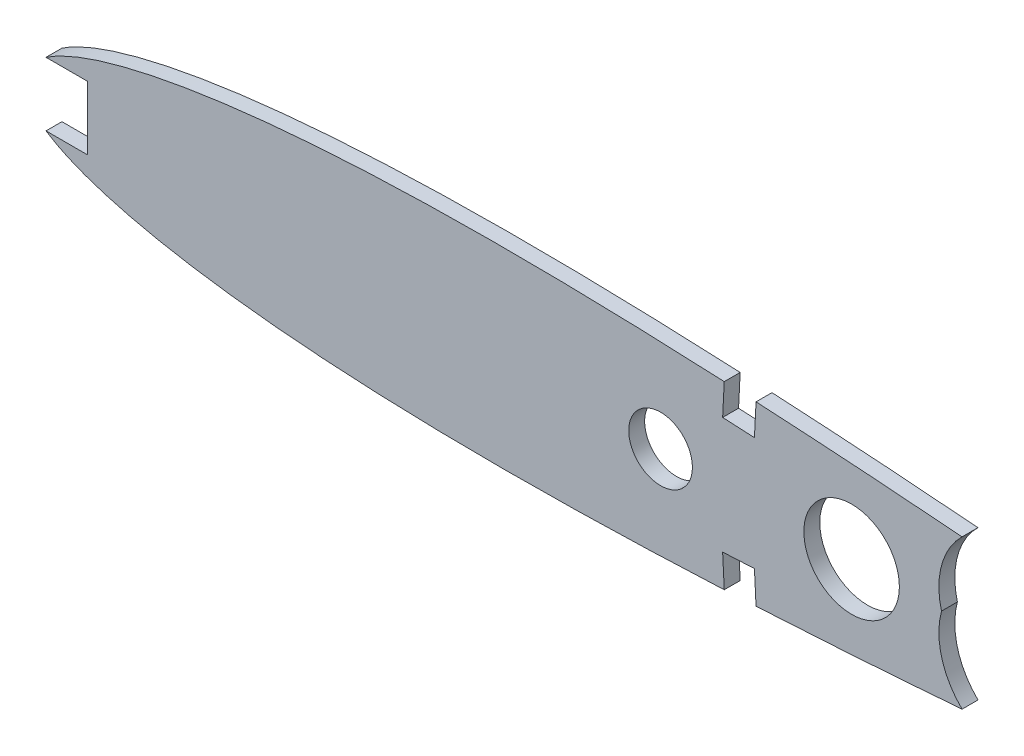
ISO-10303-21;
HEADER;
FILE_DESCRIPTION(('STEP AP214'),'2;1');
FILE_NAME('part.step','',(''),(''),'','','');
FILE_SCHEMA(('AUTOMOTIVE_DESIGN { 1 0 10303 214 1 1 1 1 }'));
ENDSEC;
DATA;
#1=APPLICATION_CONTEXT('core data for automotive mechanical design processes');
#2=APPLICATION_PROTOCOL_DEFINITION('international standard','automotive_design',2000,#1);
#3=PRODUCT_CONTEXT('',#1,'mechanical');
#4=PRODUCT('Part','Part','',(#3));
#5=PRODUCT_RELATED_PRODUCT_CATEGORY('part','',(#4));
#6=PRODUCT_DEFINITION_FORMATION('','',#4);
#7=PRODUCT_DEFINITION_CONTEXT('part definition',#1,'design');
#8=PRODUCT_DEFINITION('design','',#6,#7);
#9=PRODUCT_DEFINITION_SHAPE('','',#8);
#10=(LENGTH_UNIT() NAMED_UNIT(*) SI_UNIT(.MILLI.,.METRE.));
#11=(NAMED_UNIT(*) PLANE_ANGLE_UNIT() SI_UNIT($,.RADIAN.));
#12=(NAMED_UNIT(*) SI_UNIT($,.STERADIAN.) SOLID_ANGLE_UNIT());
#13=UNCERTAINTY_MEASURE_WITH_UNIT(LENGTH_MEASURE(1.E-05),#10,'distance_accuracy_value','');
#14=(GEOMETRIC_REPRESENTATION_CONTEXT(3) GLOBAL_UNCERTAINTY_ASSIGNED_CONTEXT((#13)) GLOBAL_UNIT_ASSIGNED_CONTEXT((#10,
#11,#12)) REPRESENTATION_CONTEXT('',''));
#15=CARTESIAN_POINT('',(0.,0.,0.));
#16=DIRECTION('',(0.,0.,1.));
#17=DIRECTION('',(1.,0.,0.));
#18=AXIS2_PLACEMENT_3D('',#15,#16,#17);
#19=CARTESIAN_POINT('',(318.77,0.4016502,3.175));
#20=CARTESIAN_POINT('',(318.651672050798,0.50081062510207,3.175));
#21=CARTESIAN_POINT('',(317.88713952083,0.407183951533016,3.175));
#22=CARTESIAN_POINT('',(316.525702267064,0.7904298347905,3.175));
#23=CARTESIAN_POINT('',(314.029007456015,1.02731081399014,3.175));
#24=CARTESIAN_POINT('',(310.665580367581,1.53568645613262,3.175));
#25=CARTESIAN_POINT('',(306.332982445315,2.1029997142592,3.175));
#26=CARTESIAN_POINT('',(301.108142880642,2.80218722429085,3.175));
#27=CARTESIAN_POINT('',(295.004655139781,3.59255228155884,3.175));
#28=CARTESIAN_POINT('',(288.066717305627,4.47252129999186,3.175));
#29=CARTESIAN_POINT('',(280.334877507848,5.42667867616247,3.175));
#30=CARTESIAN_POINT('',(271.857503413929,6.44211126091389,3.175));
#31=CARTESIAN_POINT('',(262.68670258513,7.50622472654808,3.175));
#32=CARTESIAN_POINT('',(252.878949160097,8.60453143464443,3.175));
#33=CARTESIAN_POINT('',(242.494745531819,9.72362194936592,3.175));
#34=CARTESIAN_POINT('',(231.598187206488,10.8495970231666,3.175));
#35=CARTESIAN_POINT('',(220.256428580463,11.9679230852741,3.175));
#36=CARTESIAN_POINT('',(208.539426289446,13.0629021970691,3.175));
#37=CARTESIAN_POINT('',(196.519338709918,14.1201595424354,3.175));
#38=CARTESIAN_POINT('',(184.270405083069,15.1220196708537,3.175));
#39=CARTESIAN_POINT('',(171.867889748649,16.0521472129467,3.175));
#40=CARTESIAN_POINT('',(159.388371015463,16.8932736087619,3.175));
#41=CARTESIAN_POINT('',(146.908740176365,17.6278116310836,3.175));
#42=CARTESIAN_POINT('',(134.505824676557,18.23720410278,3.175));
#43=CARTESIAN_POINT('',(122.256224526093,18.705201006698,3.175));
#44=CARTESIAN_POINT('',(110.23510919994,19.0165345268771,3.175));
#45=CARTESIAN_POINT('',(98.5167667377854,19.1559979551147,3.175));
#46=CARTESIAN_POINT('',(87.1732015056204,19.1125234147679,3.175));
#47=CARTESIAN_POINT('',(76.2743495407503,18.8777134468916,3.175));
#48=CARTESIAN_POINT('',(65.8872982521429,18.4456158754961,3.175));
#49=CARTESIAN_POINT('',(56.0759819312477,17.8151004006929,3.175));
#50=CARTESIAN_POINT('',(46.9007012854392,16.9880642018893,3.175));
#51=CARTESIAN_POINT('',(38.4176025007467,15.9709664672286,3.175));
#52=CARTESIAN_POINT('',(30.6783927826995,14.7724611931374,3.175));
#53=CARTESIAN_POINT('',(23.7299698701266,13.4050657428601,3.175));
#54=CARTESIAN_POINT('',(17.6130594258367,11.8842416218078,3.175));
#55=CARTESIAN_POINT('',(12.3624203887116,10.2248187616682,3.175));
#56=CARTESIAN_POINT('',(8.00472945000562,8.44225238170004,3.175));
#57=CARTESIAN_POINT('',(4.55388340735938,6.54860238146803,3.175));
#58=CARTESIAN_POINT('',(2.01519229032135,4.54013127991722,3.175));
#59=CARTESIAN_POINT('',(0.389181284538515,2.36824959719999,3.175));
#60=CARTESIAN_POINT('',(-0.181372315669338,0.,3.175));
#61=CARTESIAN_POINT('',(0.389181284538492,-2.36824959719995,3.175));
#62=CARTESIAN_POINT('',(2.01519229032142,-4.5401312799173,3.175));
#63=CARTESIAN_POINT('',(4.55388340735933,-6.54860238146799,3.175));
#64=CARTESIAN_POINT('',(8.00472945000561,-8.44225238170004,3.175));
#65=CARTESIAN_POINT('',(12.3624203887116,-10.2248187616682,3.175));
#66=CARTESIAN_POINT('',(17.6130594258367,-11.8842416218078,3.175));
#67=CARTESIAN_POINT('',(23.7299698701266,-13.4050657428601,3.175));
#68=CARTESIAN_POINT('',(30.6783927826996,-14.7724611931374,3.175));
#69=CARTESIAN_POINT('',(38.4176025007467,-15.9709664672285,3.175));
#70=CARTESIAN_POINT('',(46.9007012854392,-16.9880642018893,3.175));
#71=CARTESIAN_POINT('',(56.0759819312477,-17.8151004006929,3.175));
#72=CARTESIAN_POINT('',(65.8872982521429,-18.4456158754961,3.175));
#73=CARTESIAN_POINT('',(76.2743495407503,-18.8777134468916,3.175));
#74=CARTESIAN_POINT('',(87.1732015056205,-19.1125234147679,3.175));
#75=CARTESIAN_POINT('',(98.5167667377854,-19.1559979551147,3.175));
#76=CARTESIAN_POINT('',(110.23510919994,-19.0165345268771,3.175));
#77=CARTESIAN_POINT('',(122.256224526093,-18.705201006698,3.175));
#78=CARTESIAN_POINT('',(134.505824676556,-18.23720410278,3.175));
#79=CARTESIAN_POINT('',(146.908740176365,-17.6278116310836,3.175));
#80=CARTESIAN_POINT('',(159.388371015463,-16.8932736087619,3.175));
#81=CARTESIAN_POINT('',(171.867889748649,-16.0521472129467,3.175));
#82=CARTESIAN_POINT('',(184.270405083069,-15.1220196708537,3.175));
#83=CARTESIAN_POINT('',(196.519338709918,-14.1201595424354,3.175));
#84=CARTESIAN_POINT('',(208.539426289446,-13.0629021970691,3.175));
#85=CARTESIAN_POINT('',(220.256428580463,-11.9679230852741,3.175));
#86=CARTESIAN_POINT('',(231.598187206488,-10.8495970231665,3.175));
#87=CARTESIAN_POINT('',(242.494745531819,-9.72362194936593,3.175));
#88=CARTESIAN_POINT('',(252.878949160097,-8.60453143464443,3.175));
#89=CARTESIAN_POINT('',(262.68670258513,-7.50622472654809,3.175));
#90=CARTESIAN_POINT('',(271.857503413929,-6.44211126091389,3.175));
#91=CARTESIAN_POINT('',(280.334877507848,-5.42667867616247,3.175));
#92=CARTESIAN_POINT('',(288.066717305627,-4.47252129999186,3.175));
#93=CARTESIAN_POINT('',(295.004655139781,-3.59255228155884,3.175));
#94=CARTESIAN_POINT('',(301.108142880642,-2.80218722429085,3.175));
#95=CARTESIAN_POINT('',(306.332982445315,-2.10299971425921,3.175));
#96=CARTESIAN_POINT('',(310.66558036758,-1.53568645613261,3.175));
#97=CARTESIAN_POINT('',(314.029007456015,-1.02731081399015,3.175));
#98=CARTESIAN_POINT('',(316.525702267064,-0.790429834790499,3.175));
#99=CARTESIAN_POINT('',(317.88713952083,-0.407183951532999,3.175));
#100=CARTESIAN_POINT('',(318.961628570184,-0.538768719393173,3.175));
#101=CARTESIAN_POINT('',(318.961628570184,0.241062861088163,3.175));
#102=CARTESIAN_POINT('',(318.77,0.4016502,3.175));
#103=B_SPLINE_CURVE_WITH_KNOTS('',3,(#19,#20,#21,#22,#23,#24,#25,#26,#27,#28,#29,#30,#31,#32,
#33,#34,#35,#36,#37,#38,#39,#40,#41,#42,#43,#44,#45,#46,#47,#48,#49,#50,#51,#52,#53,#54,#55,#56,
#57,#58,#59,#60,#61,#62,#63,#64,#65,#66,#67,#68,#69,#70,#71,#72,#73,#74,#75,#76,#77,#78,#79,#80,
#81,#82,#83,#84,#85,#86,#87,#88,#89,#90,#91,#92,#93,#94,#95,#96,#97,#98,#99,#100,#101,#102),
.UNSPECIFIED.,.T.,.F.,(4,1,1,1,1,1,1,1,1,1,1,1,1,1,1,1,1,1,1,1,1,1,1,1,1,1,1,1,1,1,1,1,1,1,1,1,
1,1,1,1,1,1,1,1,1,1,1,1,1,1,1,1,1,1,1,1,1,1,1,1,1,1,1,1,1,1,1,1,1,1,1,1,1,1,1,1,1,1,1,1,1,4),
(0.,0.00076221465102857,0.00304470631082172,0.00683224554312919,0.0121011758037585,
0.0188175356586858,0.026939454793122,0.0364148482585568,0.0471846285955964,0.0591804130998147,
0.0723278736139124,0.0865440610891483,0.101740580336553,0.117823336433574,0.134691452208322,
0.152240154447155,0.170361289964637,0.188941007849542,0.207865435445639,0.227016078022501,
0.246275695980001,0.265524943249896,0.284644966110444,0.303520118268662,0.322034575374331,
0.340078352914118,0.357542593241702,0.374325481920834,0.390329890871888,0.405463889739095,
0.419643801445685,0.43279337139134,0.444843816743186,0.455737920704734,0.465428653233085,
0.473886320085416,0.481101634077569,0.487101684418678,0.491975368345093,0.495930677807379,
0.499382808099288,0.502834938391198,0.506790247853484,0.511663931779899,0.517663982121008,
0.524879296113161,0.533336962965492,0.543027695493843,0.553921799455391,0.565972244807237,
0.579121814752892,0.593301726459482,0.608435725326689,0.624440134277742,0.641223022956875,
0.658687263284459,0.676731040824246,0.695245497929915,0.714120650088133,0.733240672948681,
0.752489920218576,0.771749538176075,0.790900180752937,0.809824608349034,0.82840432623394,
0.846525461751422,0.864074163990254,0.880942279765002,0.897025035862024,0.912221555109428,
0.926437742584664,0.939585203098762,0.95158098760298,0.96235076794002,0.971826161405454,
0.97994808053989,0.986664440394818,0.991933370655447,0.995720909887755,0.998003401547548,
0.998765616198576,1.),.UNSPECIFIED.);
#104=DIRECTION('',(0.,0.,-1.));
#105=VECTOR('',#104,1.);
#106=SURFACE_OF_LINEAR_EXTRUSION('',#103,#105);
#107=CARTESIAN_POINT('',(318.77,0.4016502,0.));
#108=CARTESIAN_POINT('',(318.651672050798,0.50081062510207,0.));
#109=CARTESIAN_POINT('',(317.88713952083,0.407183951533016,0.));
#110=CARTESIAN_POINT('',(316.525702267064,0.7904298347905,0.));
#111=CARTESIAN_POINT('',(314.029007456015,1.02731081399014,0.));
#112=CARTESIAN_POINT('',(310.665580367581,1.53568645613262,0.));
#113=CARTESIAN_POINT('',(306.332982445315,2.1029997142592,0.));
#114=CARTESIAN_POINT('',(301.108142880642,2.80218722429085,0.));
#115=CARTESIAN_POINT('',(295.004655139781,3.59255228155884,0.));
#116=CARTESIAN_POINT('',(288.066717305627,4.47252129999186,0.));
#117=CARTESIAN_POINT('',(280.334877507848,5.42667867616247,0.));
#118=CARTESIAN_POINT('',(271.857503413929,6.44211126091389,0.));
#119=CARTESIAN_POINT('',(262.68670258513,7.50622472654808,0.));
#120=CARTESIAN_POINT('',(252.878949160097,8.60453143464443,0.));
#121=CARTESIAN_POINT('',(242.494745531819,9.72362194936592,0.));
#122=CARTESIAN_POINT('',(231.598187206488,10.8495970231666,0.));
#123=CARTESIAN_POINT('',(220.256428580463,11.9679230852741,0.));
#124=CARTESIAN_POINT('',(208.539426289446,13.0629021970691,0.));
#125=CARTESIAN_POINT('',(196.519338709918,14.1201595424354,0.));
#126=CARTESIAN_POINT('',(184.270405083069,15.1220196708537,0.));
#127=CARTESIAN_POINT('',(171.867889748649,16.0521472129467,0.));
#128=CARTESIAN_POINT('',(159.388371015463,16.8932736087619,0.));
#129=CARTESIAN_POINT('',(146.908740176365,17.6278116310836,0.));
#130=CARTESIAN_POINT('',(134.505824676557,18.23720410278,0.));
#131=CARTESIAN_POINT('',(122.256224526093,18.705201006698,0.));
#132=CARTESIAN_POINT('',(110.23510919994,19.0165345268771,0.));
#133=CARTESIAN_POINT('',(98.5167667377854,19.1559979551147,0.));
#134=CARTESIAN_POINT('',(87.1732015056204,19.1125234147679,0.));
#135=CARTESIAN_POINT('',(76.2743495407503,18.8777134468916,0.));
#136=CARTESIAN_POINT('',(65.8872982521429,18.4456158754961,0.));
#137=CARTESIAN_POINT('',(56.0759819312477,17.8151004006929,0.));
#138=CARTESIAN_POINT('',(46.9007012854392,16.9880642018893,0.));
#139=CARTESIAN_POINT('',(38.4176025007467,15.9709664672286,0.));
#140=CARTESIAN_POINT('',(30.6783927826995,14.7724611931374,0.));
#141=CARTESIAN_POINT('',(23.7299698701266,13.4050657428601,0.));
#142=CARTESIAN_POINT('',(17.6130594258367,11.8842416218078,0.));
#143=CARTESIAN_POINT('',(12.3624203887116,10.2248187616682,0.));
#144=CARTESIAN_POINT('',(8.00472945000562,8.44225238170004,0.));
#145=CARTESIAN_POINT('',(4.55388340735938,6.54860238146803,0.));
#146=CARTESIAN_POINT('',(2.01519229032135,4.54013127991722,0.));
#147=CARTESIAN_POINT('',(0.389181284538515,2.36824959719999,0.));
#148=CARTESIAN_POINT('',(-0.181372315669338,0.,0.));
#149=CARTESIAN_POINT('',(0.389181284538492,-2.36824959719995,0.));
#150=CARTESIAN_POINT('',(2.01519229032142,-4.5401312799173,0.));
#151=CARTESIAN_POINT('',(4.55388340735933,-6.54860238146799,0.));
#152=CARTESIAN_POINT('',(8.00472945000561,-8.44225238170004,0.));
#153=CARTESIAN_POINT('',(12.3624203887116,-10.2248187616682,0.));
#154=CARTESIAN_POINT('',(17.6130594258367,-11.8842416218078,0.));
#155=CARTESIAN_POINT('',(23.7299698701266,-13.4050657428601,0.));
#156=CARTESIAN_POINT('',(30.6783927826996,-14.7724611931374,0.));
#157=CARTESIAN_POINT('',(38.4176025007467,-15.9709664672285,0.));
#158=CARTESIAN_POINT('',(46.9007012854392,-16.9880642018893,0.));
#159=CARTESIAN_POINT('',(56.0759819312477,-17.8151004006929,0.));
#160=CARTESIAN_POINT('',(65.8872982521429,-18.4456158754961,0.));
#161=CARTESIAN_POINT('',(76.2743495407503,-18.8777134468916,0.));
#162=CARTESIAN_POINT('',(87.1732015056205,-19.1125234147679,0.));
#163=CARTESIAN_POINT('',(98.5167667377854,-19.1559979551147,0.));
#164=CARTESIAN_POINT('',(110.23510919994,-19.0165345268771,0.));
#165=CARTESIAN_POINT('',(122.256224526093,-18.705201006698,0.));
#166=CARTESIAN_POINT('',(134.505824676556,-18.23720410278,0.));
#167=CARTESIAN_POINT('',(146.908740176365,-17.6278116310836,0.));
#168=CARTESIAN_POINT('',(159.388371015463,-16.8932736087619,0.));
#169=CARTESIAN_POINT('',(171.867889748649,-16.0521472129467,0.));
#170=CARTESIAN_POINT('',(184.270405083069,-15.1220196708537,0.));
#171=CARTESIAN_POINT('',(196.519338709918,-14.1201595424354,0.));
#172=CARTESIAN_POINT('',(208.539426289446,-13.0629021970691,0.));
#173=CARTESIAN_POINT('',(220.256428580463,-11.9679230852741,0.));
#174=CARTESIAN_POINT('',(231.598187206488,-10.8495970231665,0.));
#175=CARTESIAN_POINT('',(242.494745531819,-9.72362194936593,0.));
#176=CARTESIAN_POINT('',(252.878949160097,-8.60453143464443,0.));
#177=CARTESIAN_POINT('',(262.68670258513,-7.50622472654809,0.));
#178=CARTESIAN_POINT('',(271.857503413929,-6.44211126091389,0.));
#179=CARTESIAN_POINT('',(280.334877507848,-5.42667867616247,0.));
#180=CARTESIAN_POINT('',(288.066717305627,-4.47252129999186,0.));
#181=CARTESIAN_POINT('',(295.004655139781,-3.59255228155884,0.));
#182=CARTESIAN_POINT('',(301.108142880642,-2.80218722429085,0.));
#183=CARTESIAN_POINT('',(306.332982445315,-2.10299971425921,0.));
#184=CARTESIAN_POINT('',(310.66558036758,-1.53568645613261,0.));
#185=CARTESIAN_POINT('',(314.029007456015,-1.02731081399015,0.));
#186=CARTESIAN_POINT('',(316.525702267064,-0.790429834790499,0.));
#187=CARTESIAN_POINT('',(317.88713952083,-0.407183951532999,0.));
#188=CARTESIAN_POINT('',(318.961628570184,-0.538768719393173,0.));
#189=CARTESIAN_POINT('',(318.961628570184,0.241062861088163,0.));
#190=CARTESIAN_POINT('',(318.77,0.4016502,0.));
#191=B_SPLINE_CURVE_WITH_KNOTS('',3,(#107,#108,#109,#110,#111,#112,#113,#114,#115,#116,#117,
#118,#119,#120,#121,#122,#123,#124,#125,#126,#127,#128,#129,#130,#131,#132,#133,#134,#135,#136,
#137,#138,#139,#140,#141,#142,#143,#144,#145,#146,#147,#148,#149,#150,#151,#152,#153,#154,#155,
#156,#157,#158,#159,#160,#161,#162,#163,#164,#165,#166,#167,#168,#169,#170,#171,#172,#173,#174,
#175,#176,#177,#178,#179,#180,#181,#182,#183,#184,#185,#186,#187,#188,#189,#190),.UNSPECIFIED.,
.T.,.F.,(4,1,1,1,1,1,1,1,1,1,1,1,1,1,1,1,1,1,1,1,1,1,1,1,1,1,1,1,1,1,1,1,1,1,1,1,1,1,1,1,1,1,1,
1,1,1,1,1,1,1,1,1,1,1,1,1,1,1,1,1,1,1,1,1,1,1,1,1,1,1,1,1,1,1,1,1,1,1,1,1,1,4),(0.,
0.00076221465102857,0.00304470631082172,0.00683224554312919,0.0121011758037585,
0.0188175356586858,0.026939454793122,0.0364148482585568,0.0471846285955964,0.0591804130998147,
0.0723278736139124,0.0865440610891483,0.101740580336553,0.117823336433574,0.134691452208322,
0.152240154447155,0.170361289964637,0.188941007849542,0.207865435445639,0.227016078022501,
0.246275695980001,0.265524943249896,0.284644966110444,0.303520118268662,0.322034575374331,
0.340078352914118,0.357542593241702,0.374325481920834,0.390329890871888,0.405463889739095,
0.419643801445685,0.43279337139134,0.444843816743186,0.455737920704734,0.465428653233085,
0.473886320085416,0.481101634077569,0.487101684418678,0.491975368345093,0.495930677807379,
0.499382808099288,0.502834938391198,0.506790247853484,0.511663931779899,0.517663982121008,
0.524879296113161,0.533336962965492,0.543027695493843,0.553921799455391,0.565972244807237,
0.579121814752892,0.593301726459482,0.608435725326689,0.624440134277742,0.641223022956875,
0.658687263284459,0.676731040824246,0.695245497929915,0.714120650088133,0.733240672948681,
0.752489920218576,0.771749538176075,0.790900180752937,0.809824608349034,0.82840432623394,
0.846525461751422,0.864074163990254,0.880942279765002,0.897025035862024,0.912221555109428,
0.926437742584664,0.939585203098762,0.95158098760298,0.96235076794002,0.971826161405454,
0.97994808053989,0.986664440394818,0.991933370655447,0.995720909887755,0.998003401547548,
0.998765616198576,1.),.UNSPECIFIED.);
#192=CARTESIAN_POINT('',(146.04183221628,-17.6541230833231,0.));
#193=VERTEX_POINT('',#192);
#194=CARTESIAN_POINT('',(187.131379050379,-14.8815283728172,0.));
#195=VERTEX_POINT('',#194);
#196=EDGE_CURVE('E317',#193,#195,#191,.T.);
#197=ORIENTED_EDGE('',*,*,#196,.T.);
#198=DIRECTION('',(0.,0.,-1.));
#199=VECTOR('',#198,1.);
#200=CARTESIAN_POINT('',(187.131379050379,-14.8815283728172,3.175));
#201=LINE('',#200,#199);
#202=CARTESIAN_POINT('',(187.131379050379,-14.8815283728172,3.175));
#203=VERTEX_POINT('',#202);
#204=EDGE_CURVE('E197',#195,#203,#201,.F.);
#205=ORIENTED_EDGE('',*,*,#204,.T.);
#206=CARTESIAN_POINT('',(146.04183221628,-17.6541230833231,3.175));
#207=VERTEX_POINT('',#206);
#208=EDGE_CURVE('E185',#207,#203,#103,.T.);
#209=ORIENTED_EDGE('',*,*,#208,.F.);
#210=DIRECTION('',(0.,0.,-1.));
#211=VECTOR('',#210,1.);
#212=CARTESIAN_POINT('',(146.041832216277,-17.6541230832735,3.175));
#213=LINE('',#212,#211);
#214=EDGE_CURVE('E258',#207,#193,#213,.T.);
#215=ORIENTED_EDGE('',*,*,#214,.T.);
#216=EDGE_LOOP('',(#197,#205,#209,#215));
#217=FACE_BOUND('',#216,.T.);
#218=ADVANCED_FACE('F56',(#217),#106,.F.);
#219=DIRECTION('',(0.,0.,-1.));
#220=VECTOR('',#219,1.);
#221=CARTESIAN_POINT('',(4.43514152489335,-6.35,3.175));
#222=LINE('',#221,#220);
#223=CARTESIAN_POINT('',(4.43514152741509,-6.35,0.));
#224=VERTEX_POINT('',#223);
#225=CARTESIAN_POINT('',(4.43514152741509,-6.35,3.175));
#226=VERTEX_POINT('',#225);
#227=EDGE_CURVE('E224',#224,#226,#222,.F.);
#228=ORIENTED_EDGE('',*,*,#227,.F.);
#229=CARTESIAN_POINT('',(139.700000000002,-17.9760922442452,0.));
#230=VERTEX_POINT('',#229);
#231=EDGE_CURVE('E326',#224,#230,#191,.T.);
#232=ORIENTED_EDGE('',*,*,#231,.T.);
#233=DIRECTION('',(0.,0.,-1.));
#234=VECTOR('',#233,1.);
#235=CARTESIAN_POINT('',(139.7,-17.9760922441977,3.175));
#236=LINE('',#235,#234);
#237=CARTESIAN_POINT('',(139.700000000002,-17.9760922442452,3.175));
#238=VERTEX_POINT('',#237);
#239=EDGE_CURVE('E297',#230,#238,#236,.F.);
#240=ORIENTED_EDGE('',*,*,#239,.T.);
#241=EDGE_CURVE('E314',#226,#238,#103,.T.);
#242=ORIENTED_EDGE('',*,*,#241,.F.);
#243=EDGE_LOOP('',(#228,#232,#240,#242));
#244=FACE_BOUND('',#243,.T.);
#245=ADVANCED_FACE('F58',(#244),#106,.F.);
#246=CARTESIAN_POINT('',(139.700000000002,17.9760922442452,0.));
#247=VERTEX_POINT('',#246);
#248=CARTESIAN_POINT('',(4.435141527415,6.35,0.));
#249=VERTEX_POINT('',#248);
#250=EDGE_CURVE('E327',#247,#249,#191,.T.);
#251=ORIENTED_EDGE('',*,*,#250,.T.);
#252=DIRECTION('',(0.,0.,-1.));
#253=VECTOR('',#252,1.);
#254=CARTESIAN_POINT('',(4.43514152489341,6.35000000000004,3.175));
#255=LINE('',#254,#253);
#256=CARTESIAN_POINT('',(4.435141527415,6.35,3.175));
#257=VERTEX_POINT('',#256);
#258=EDGE_CURVE('E229',#249,#257,#255,.F.);
#259=ORIENTED_EDGE('',*,*,#258,.T.);
#260=CARTESIAN_POINT('',(139.700000000002,17.9760922442452,3.175));
#261=VERTEX_POINT('',#260);
#262=EDGE_CURVE('E316',#261,#257,#103,.T.);
#263=ORIENTED_EDGE('',*,*,#262,.F.);
#264=DIRECTION('',(0.,0.,-1.));
#265=VECTOR('',#264,1.);
#266=CARTESIAN_POINT('',(139.7,17.9760922441977,3.175));
#267=LINE('',#266,#265);
#268=EDGE_CURVE('E301',#261,#247,#267,.T.);
#269=ORIENTED_EDGE('',*,*,#268,.T.);
#270=EDGE_LOOP('',(#251,#259,#263,#269));
#271=FACE_BOUND('',#270,.T.);
#272=ADVANCED_FACE('F346',(#271),#106,.F.);
#273=CARTESIAN_POINT('',(187.131379050379,14.8815283728172,3.175));
#274=VERTEX_POINT('',#273);
#275=CARTESIAN_POINT('',(146.04183221628,17.6541230833231,3.175));
#276=VERTEX_POINT('',#275);
#277=EDGE_CURVE('E315',#274,#276,#103,.T.);
#278=ORIENTED_EDGE('',*,*,#277,.F.);
#279=DIRECTION('',(0.,0.,-1.));
#280=VECTOR('',#279,1.);
#281=CARTESIAN_POINT('',(187.131379050379,14.8815283728172,3.175));
#282=LINE('',#281,#280);
#283=CARTESIAN_POINT('',(187.131379050379,14.8815283728172,0.));
#284=VERTEX_POINT('',#283);
#285=EDGE_CURVE('E170',#274,#284,#282,.T.);
#286=ORIENTED_EDGE('',*,*,#285,.T.);
#287=CARTESIAN_POINT('',(146.04183221628,17.6541230833231,0.));
#288=VERTEX_POINT('',#287);
#289=EDGE_CURVE('E308',#284,#288,#191,.T.);
#290=ORIENTED_EDGE('',*,*,#289,.T.);
#291=DIRECTION('',(0.,0.,-1.));
#292=VECTOR('',#291,1.);
#293=CARTESIAN_POINT('',(146.041832216277,17.6541230832735,3.175));
#294=LINE('',#293,#292);
#295=EDGE_CURVE('E305',#288,#276,#294,.F.);
#296=ORIENTED_EDGE('',*,*,#295,.T.);
#297=EDGE_LOOP('',(#278,#286,#290,#296));
#298=FACE_BOUND('',#297,.T.);
#299=ADVANCED_FACE('F366',(#298),#106,.F.);
#300=CARTESIAN_POINT('',(0.0170900845920282,-0.403411610866982,3.175));
#301=DIRECTION('',(0.,0.,-1.));
#302=DIRECTION('',(-1.,0.,0.));
#303=AXIS2_PLACEMENT_3D('',#300,#301,#302);
#304=PLANE('',#303);
#305=CARTESIAN_POINT('',(165.1,0.,3.175));
#306=DIRECTION('',(0.,0.,1.));
#307=DIRECTION('',(1.,0.,0.));
#308=AXIS2_PLACEMENT_3D('',#305,#306,#307);
#309=CIRCLE('',#308,9.525);
#310=CARTESIAN_POINT('',(174.625,0.,3.175));
#311=VERTEX_POINT('',#310);
#312=EDGE_CURVE('E191',#311,#311,#309,.T.);
#313=ORIENTED_EDGE('',*,*,#312,.F.);
#314=EDGE_LOOP('',(#313));
#315=FACE_BOUND('',#314,.T.);
#316=CARTESIAN_POINT('',(127.,0.,3.175));
#317=DIRECTION('',(0.,0.,1.));
#318=DIRECTION('',(1.,0.,0.));
#319=AXIS2_PLACEMENT_3D('',#316,#317,#318);
#320=CIRCLE('',#319,6.35);
#321=CARTESIAN_POINT('',(133.35,0.,3.175));
#322=VERTEX_POINT('',#321);
#323=EDGE_CURVE('E265',#322,#322,#320,.T.);
#324=ORIENTED_EDGE('',*,*,#323,.F.);
#325=EDGE_LOOP('',(#324));
#326=FACE_BOUND('',#325,.T.);
#327=ORIENTED_EDGE('',*,*,#208,.T.);
#328=CARTESIAN_POINT('',(197.744431020284,-3.94440224736243,3.175));
#329=DIRECTION('',(0.,0.,1.));
#330=DIRECTION('',(1.,0.,0.));
#331=AXIS2_PLACEMENT_3D('',#328,#329,#330);
#332=CIRCLE('',#331,15.24);
#333=CARTESIAN_POINT('',(183.023721427638,0.,3.175));
#334=VERTEX_POINT('',#333);
#335=EDGE_CURVE('E175',#334,#203,#332,.T.);
#336=ORIENTED_EDGE('',*,*,#335,.F.);
#337=CARTESIAN_POINT('',(197.744431020284,3.94440224736244,3.175));
#338=DIRECTION('',(0.,0.,1.));
#339=DIRECTION('',(1.,0.,0.));
#340=AXIS2_PLACEMENT_3D('',#337,#338,#339);
#341=CIRCLE('',#340,15.24);
#342=EDGE_CURVE('E165',#274,#334,#341,.T.);
#343=ORIENTED_EDGE('',*,*,#342,.F.);
#344=ORIENTED_EDGE('',*,*,#277,.T.);
#345=DIRECTION('',(0.050703804869963,0.998713734846832,0.));
#346=VECTOR('',#345,1.);
#347=CARTESIAN_POINT('',(146.041832216277,17.6541230832735,3.175));
#348=LINE('',#347,#346);
#349=CARTESIAN_POINT('',(145.719448384264,11.3041230832735,3.175));
#350=VERTEX_POINT('',#349);
#351=EDGE_CURVE('E239',#350,#276,#348,.T.);
#352=ORIENTED_EDGE('',*,*,#351,.F.);
#353=DIRECTION('',(0.998713734846832,-0.0507038048699638,0.));
#354=VECTOR('',#353,1.);
#355=CARTESIAN_POINT('',(145.719448384264,11.3041230832735,3.175));
#356=LINE('',#355,#354);
#357=CARTESIAN_POINT('',(139.377616167987,11.6260922441977,3.175));
#358=VERTEX_POINT('',#357);
#359=EDGE_CURVE('E247',#358,#350,#356,.T.);
#360=ORIENTED_EDGE('',*,*,#359,.F.);
#361=DIRECTION('',(-0.0507038048699674,-0.998713734846832,0.));
#362=VECTOR('',#361,1.);
#363=CARTESIAN_POINT('',(139.7,17.9760922441977,3.175));
#364=LINE('',#363,#362);
#365=EDGE_CURVE('E244',#261,#358,#364,.T.);
#366=ORIENTED_EDGE('',*,*,#365,.F.);
#367=ORIENTED_EDGE('',*,*,#262,.T.);
#368=DIRECTION('',(-1.,0.,0.));
#369=VECTOR('',#368,1.);
#370=CARTESIAN_POINT('',(12.7,6.35,3.175));
#371=LINE('',#370,#369);
#372=CARTESIAN_POINT('',(12.7,6.35,3.175));
#373=VERTEX_POINT('',#372);
#374=EDGE_CURVE('E200',#373,#257,#371,.T.);
#375=ORIENTED_EDGE('',*,*,#374,.F.);
#376=DIRECTION('',(0.,-1.,0.));
#377=VECTOR('',#376,1.);
#378=CARTESIAN_POINT('',(12.7,6.35,3.175));
#379=LINE('',#378,#377);
#380=CARTESIAN_POINT('',(12.7,-6.35,3.175));
#381=VERTEX_POINT('',#380);
#382=EDGE_CURVE('E206',#373,#381,#379,.T.);
#383=ORIENTED_EDGE('',*,*,#382,.T.);
#384=DIRECTION('',(-1.,0.,0.));
#385=VECTOR('',#384,1.);
#386=CARTESIAN_POINT('',(12.7,-6.35,3.175));
#387=LINE('',#386,#385);
#388=EDGE_CURVE('E214',#381,#226,#387,.T.);
#389=ORIENTED_EDGE('',*,*,#388,.T.);
#390=ORIENTED_EDGE('',*,*,#241,.T.);
#391=DIRECTION('',(0.0507038048699837,-0.998713734846831,0.));
#392=VECTOR('',#391,1.);
#393=CARTESIAN_POINT('',(139.7,-17.9760922441977,3.175));
#394=LINE('',#393,#392);
#395=CARTESIAN_POINT('',(139.377616167987,-11.6260922441977,3.175));
#396=VERTEX_POINT('',#395);
#397=EDGE_CURVE('E275',#396,#238,#394,.T.);
#398=ORIENTED_EDGE('',*,*,#397,.F.);
#399=DIRECTION('',(-0.998713734846832,-0.0507038048699681,0.));
#400=VECTOR('',#399,1.);
#401=CARTESIAN_POINT('',(145.719448384264,-11.3041230832734,3.175));
#402=LINE('',#401,#400);
#403=CARTESIAN_POINT('',(145.719448384264,-11.3041230832734,3.175));
#404=VERTEX_POINT('',#403);
#405=EDGE_CURVE('E282',#404,#396,#402,.T.);
#406=ORIENTED_EDGE('',*,*,#405,.F.);
#407=DIRECTION('',(-0.0507038048699628,0.998713734846832,0.));
#408=VECTOR('',#407,1.);
#409=CARTESIAN_POINT('',(145.719448384264,-11.3041230832734,3.175));
#410=LINE('',#409,#408);
#411=EDGE_CURVE('E233',#207,#404,#410,.T.);
#412=ORIENTED_EDGE('',*,*,#411,.F.);
#413=EDGE_LOOP('',(#327,#336,#343,#344,#352,#360,#366,#367,#375,#383,#389,#390,#398,#406,#412));
#414=FACE_BOUND('',#413,.T.);
#415=ADVANCED_FACE('F182',(#315,#326,#414),#304,.F.);
#416=CARTESIAN_POINT('',(0.0170900845920282,-0.403411610866982,0.));
#417=DIRECTION('',(0.,0.,-1.));
#418=DIRECTION('',(-1.,0.,0.));
#419=AXIS2_PLACEMENT_3D('',#416,#417,#418);
#420=PLANE('',#419);
#421=CARTESIAN_POINT('',(165.1,0.,0.));
#422=DIRECTION('',(0.,0.,-1.));
#423=DIRECTION('',(-1.,0.,0.));
#424=AXIS2_PLACEMENT_3D('',#421,#422,#423);
#425=CIRCLE('',#424,9.525);
#426=CARTESIAN_POINT('',(155.575,0.,0.));
#427=VERTEX_POINT('',#426);
#428=EDGE_CURVE('E61',#427,#427,#425,.T.);
#429=ORIENTED_EDGE('',*,*,#428,.F.);
#430=EDGE_LOOP('',(#429));
#431=FACE_BOUND('',#430,.T.);
#432=CARTESIAN_POINT('',(197.744431020284,-3.94440224736243,0.));
#433=DIRECTION('',(0.,0.,1.));
#434=DIRECTION('',(1.,0.,0.));
#435=AXIS2_PLACEMENT_3D('',#432,#433,#434);
#436=CIRCLE('',#435,15.24);
#437=CARTESIAN_POINT('',(183.023721427638,0.,0.));
#438=VERTEX_POINT('',#437);
#439=EDGE_CURVE('E74',#438,#195,#436,.T.);
#440=ORIENTED_EDGE('',*,*,#439,.T.);
#441=ORIENTED_EDGE('',*,*,#196,.F.);
#442=DIRECTION('',(0.0507038048699628,-0.998713734846832,0.));
#443=VECTOR('',#442,1.);
#444=CARTESIAN_POINT('',(144.792869094204,6.94672546312251,0.));
#445=LINE('',#444,#443);
#446=CARTESIAN_POINT('',(145.719448384264,-11.3041230832734,0.));
#447=VERTEX_POINT('',#446);
#448=EDGE_CURVE('E328',#447,#193,#445,.T.);
#449=ORIENTED_EDGE('',*,*,#448,.F.);
#450=DIRECTION('',(-0.998713734846832,-0.0507038048699681,0.));
#451=VECTOR('',#450,1.);
#452=CARTESIAN_POINT('',(145.719448384264,-11.3041230832734,0.));
#453=LINE('',#452,#451);
#454=CARTESIAN_POINT('',(139.377616167987,-11.6260922441977,0.));
#455=VERTEX_POINT('',#454);
#456=EDGE_CURVE('E270',#447,#455,#453,.T.);
#457=ORIENTED_EDGE('',*,*,#456,.T.);
#458=DIRECTION('',(0.050703804869963,-0.998713734846832,0.));
#459=VECTOR('',#458,1.);
#460=CARTESIAN_POINT('',(139.377616167987,-11.6260922441977,0.));
#461=LINE('',#460,#459);
#462=EDGE_CURVE('E274',#455,#230,#461,.T.);
#463=ORIENTED_EDGE('',*,*,#462,.T.);
#464=ORIENTED_EDGE('',*,*,#231,.F.);
#465=DIRECTION('',(-1.,0.,0.));
#466=VECTOR('',#465,1.);
#467=CARTESIAN_POINT('',(12.7,-6.35,0.));
#468=LINE('',#467,#466);
#469=CARTESIAN_POINT('',(12.7,-6.35,0.));
#470=VERTEX_POINT('',#469);
#471=EDGE_CURVE('E205',#470,#224,#468,.T.);
#472=ORIENTED_EDGE('',*,*,#471,.F.);
#473=DIRECTION('',(0.,-1.,0.));
#474=VECTOR('',#473,1.);
#475=CARTESIAN_POINT('',(12.7,6.35,0.));
#476=LINE('',#475,#474);
#477=CARTESIAN_POINT('',(12.7,6.35,0.));
#478=VERTEX_POINT('',#477);
#479=EDGE_CURVE('E209',#478,#470,#476,.T.);
#480=ORIENTED_EDGE('',*,*,#479,.F.);
#481=DIRECTION('',(-1.,0.,0.));
#482=VECTOR('',#481,1.);
#483=CARTESIAN_POINT('',(12.7,6.35,0.));
#484=LINE('',#483,#482);
#485=EDGE_CURVE('E201',#478,#249,#484,.T.);
#486=ORIENTED_EDGE('',*,*,#485,.T.);
#487=ORIENTED_EDGE('',*,*,#250,.F.);
#488=DIRECTION('',(0.0507038048699674,0.998713734846832,0.));
#489=VECTOR('',#488,1.);
#490=CARTESIAN_POINT('',(138.410180490557,-7.42950528161438,0.));
#491=LINE('',#490,#489);
#492=CARTESIAN_POINT('',(139.377616167987,11.6260922441977,0.));
#493=VERTEX_POINT('',#492);
#494=EDGE_CURVE('E67',#493,#247,#491,.T.);
#495=ORIENTED_EDGE('',*,*,#494,.F.);
#496=DIRECTION('',(0.998713734846832,-0.0507038048699638,0.));
#497=VECTOR('',#496,1.);
#498=CARTESIAN_POINT('',(145.719448384264,11.3041230832735,0.));
#499=LINE('',#498,#497);
#500=CARTESIAN_POINT('',(145.719448384264,11.3041230832735,0.));
#501=VERTEX_POINT('',#500);
#502=EDGE_CURVE('E238',#493,#501,#499,.T.);
#503=ORIENTED_EDGE('',*,*,#502,.T.);
#504=DIRECTION('',(0.050703804869962,0.998713734846832,0.));
#505=VECTOR('',#504,1.);
#506=CARTESIAN_POINT('',(146.041832216277,17.6541230832735,0.));
#507=LINE('',#506,#505);
#508=EDGE_CURVE('E234',#501,#288,#507,.T.);
#509=ORIENTED_EDGE('',*,*,#508,.T.);
#510=ORIENTED_EDGE('',*,*,#289,.F.);
#511=CARTESIAN_POINT('',(197.744431020284,3.94440224736244,0.));
#512=DIRECTION('',(0.,0.,-1.));
#513=DIRECTION('',(-1.,0.,0.));
#514=AXIS2_PLACEMENT_3D('',#511,#512,#513);
#515=CIRCLE('',#514,15.24);
#516=EDGE_CURVE('E12',#438,#284,#515,.T.);
#517=ORIENTED_EDGE('',*,*,#516,.F.);
#518=EDGE_LOOP('',(#440,#441,#449,#457,#463,#464,#472,#480,#486,#487,#495,#503,#509,#510,#517));
#519=FACE_BOUND('',#518,.T.);
#520=CARTESIAN_POINT('',(127.,0.,0.));
#521=DIRECTION('',(0.,0.,1.));
#522=DIRECTION('',(1.,0.,0.));
#523=AXIS2_PLACEMENT_3D('',#520,#521,#522);
#524=CIRCLE('',#523,6.35);
#525=CARTESIAN_POINT('',(133.35,0.,0.));
#526=VERTEX_POINT('',#525);
#527=EDGE_CURVE('E248',#526,#526,#524,.T.);
#528=ORIENTED_EDGE('',*,*,#527,.T.);
#529=EDGE_LOOP('',(#528));
#530=FACE_BOUND('',#529,.T.);
#531=ADVANCED_FACE('F348',(#431,#519,#530),#420,.T.);
#532=CARTESIAN_POINT('',(139.7,-17.9760922441977,0.));
#533=DIRECTION('',(-0.998713734846831,-0.0507038048699837,0.));
#534=DIRECTION('',(0.0507038048699837,-0.998713734846831,0.));
#535=AXIS2_PLACEMENT_3D('',#532,#533,#534);
#536=PLANE('',#535);
#537=ORIENTED_EDGE('',*,*,#462,.F.);
#538=DIRECTION('',(0.,0.,1.));
#539=VECTOR('',#538,1.);
#540=CARTESIAN_POINT('',(139.377616167987,-11.6260922441977,0.));
#541=LINE('',#540,#539);
#542=EDGE_CURVE('E269',#455,#396,#541,.T.);
#543=ORIENTED_EDGE('',*,*,#542,.T.);
#544=ORIENTED_EDGE('',*,*,#397,.T.);
#545=ORIENTED_EDGE('',*,*,#239,.F.);
#546=EDGE_LOOP('',(#537,#543,#544,#545));
#547=FACE_BOUND('',#546,.T.);
#548=ADVANCED_FACE('F384',(#547),#536,.F.);
#549=CARTESIAN_POINT('',(145.719448384264,-11.3041230832734,0.));
#550=DIRECTION('',(0.998713734846832,0.0507038048699628,0.));
#551=DIRECTION('',(-0.0507038048699628,0.998713734846832,0.));
#552=AXIS2_PLACEMENT_3D('',#549,#550,#551);
#553=PLANE('',#552);
#554=ORIENTED_EDGE('',*,*,#411,.T.);
#555=DIRECTION('',(0.,0.,1.));
#556=VECTOR('',#555,1.);
#557=CARTESIAN_POINT('',(145.719448384264,-11.3041230832734,0.));
#558=LINE('',#557,#556);
#559=EDGE_CURVE('E279',#447,#404,#558,.T.);
#560=ORIENTED_EDGE('',*,*,#559,.F.);
#561=ORIENTED_EDGE('',*,*,#448,.T.);
#562=ORIENTED_EDGE('',*,*,#214,.F.);
#563=EDGE_LOOP('',(#554,#560,#561,#562));
#564=FACE_BOUND('',#563,.T.);
#565=ADVANCED_FACE('F407',(#564),#553,.F.);
#566=CARTESIAN_POINT('',(145.719448384264,-11.3041230832734,0.));
#567=DIRECTION('',(-0.0507038048699681,0.998713734846832,0.));
#568=DIRECTION('',(-0.998713734846832,-0.0507038048699681,0.));
#569=AXIS2_PLACEMENT_3D('',#566,#567,#568);
#570=PLANE('',#569);
#571=ORIENTED_EDGE('',*,*,#405,.T.);
#572=ORIENTED_EDGE('',*,*,#542,.F.);
#573=ORIENTED_EDGE('',*,*,#456,.F.);
#574=ORIENTED_EDGE('',*,*,#559,.T.);
#575=EDGE_LOOP('',(#571,#572,#573,#574));
#576=FACE_BOUND('',#575,.T.);
#577=ADVANCED_FACE('F410',(#576),#570,.F.);
#578=CARTESIAN_POINT('',(127.,0.,0.));
#579=DIRECTION('',(0.,0.,1.));
#580=DIRECTION('',(1.,0.,0.));
#581=AXIS2_PLACEMENT_3D('',#578,#579,#580);
#582=CYLINDRICAL_SURFACE('',#581,6.35);
#583=ORIENTED_EDGE('',*,*,#527,.F.);
#584=EDGE_LOOP('',(#583));
#585=FACE_BOUND('',#584,.T.);
#586=ORIENTED_EDGE('',*,*,#323,.T.);
#587=EDGE_LOOP('',(#586));
#588=FACE_BOUND('',#587,.T.);
#589=ADVANCED_FACE('F414',(#585,#588),#582,.F.);
#590=CARTESIAN_POINT('',(146.041832216277,17.6541230832735,0.));
#591=DIRECTION('',(0.998713734846832,-0.050703804869963,0.));
#592=DIRECTION('',(0.050703804869963,0.998713734846832,0.));
#593=AXIS2_PLACEMENT_3D('',#590,#591,#592);
#594=PLANE('',#593);
#595=ORIENTED_EDGE('',*,*,#508,.F.);
#596=DIRECTION('',(0.,0.,1.));
#597=VECTOR('',#596,1.);
#598=CARTESIAN_POINT('',(145.719448384264,11.3041230832735,0.));
#599=LINE('',#598,#597);
#600=EDGE_CURVE('E255',#501,#350,#599,.T.);
#601=ORIENTED_EDGE('',*,*,#600,.T.);
#602=ORIENTED_EDGE('',*,*,#351,.T.);
#603=ORIENTED_EDGE('',*,*,#295,.F.);
#604=EDGE_LOOP('',(#595,#601,#602,#603));
#605=FACE_BOUND('',#604,.T.);
#606=ADVANCED_FACE('F368',(#605),#594,.F.);
#607=CARTESIAN_POINT('',(139.7,17.9760922441977,0.));
#608=DIRECTION('',(-0.998713734846832,0.0507038048699674,0.));
#609=DIRECTION('',(-0.0507038048699674,-0.998713734846832,0.));
#610=AXIS2_PLACEMENT_3D('',#607,#608,#609);
#611=PLANE('',#610);
#612=ORIENTED_EDGE('',*,*,#365,.T.);
#613=DIRECTION('',(0.,0.,1.));
#614=VECTOR('',#613,1.);
#615=CARTESIAN_POINT('',(139.377616167987,11.6260922441977,0.));
#616=LINE('',#615,#614);
#617=EDGE_CURVE('E243',#493,#358,#616,.T.);
#618=ORIENTED_EDGE('',*,*,#617,.F.);
#619=ORIENTED_EDGE('',*,*,#494,.T.);
#620=ORIENTED_EDGE('',*,*,#268,.F.);
#621=EDGE_LOOP('',(#612,#618,#619,#620));
#622=FACE_BOUND('',#621,.T.);
#623=ADVANCED_FACE('F339',(#622),#611,.F.);
#624=CARTESIAN_POINT('',(145.719448384264,11.3041230832735,0.));
#625=DIRECTION('',(-0.0507038048699638,-0.998713734846832,0.));
#626=DIRECTION('',(0.998713734846832,-0.0507038048699638,0.));
#627=AXIS2_PLACEMENT_3D('',#624,#625,#626);
#628=PLANE('',#627);
#629=ORIENTED_EDGE('',*,*,#359,.T.);
#630=ORIENTED_EDGE('',*,*,#600,.F.);
#631=ORIENTED_EDGE('',*,*,#502,.F.);
#632=ORIENTED_EDGE('',*,*,#617,.T.);
#633=EDGE_LOOP('',(#629,#630,#631,#632));
#634=FACE_BOUND('',#633,.T.);
#635=ADVANCED_FACE('F372',(#634),#628,.F.);
#636=CARTESIAN_POINT('',(12.7,6.35,0.));
#637=DIRECTION('',(0.,1.,0.));
#638=DIRECTION('',(-1.,0.,0.));
#639=AXIS2_PLACEMENT_3D('',#636,#637,#638);
#640=PLANE('',#639);
#641=ORIENTED_EDGE('',*,*,#485,.F.);
#642=DIRECTION('',(0.,0.,1.));
#643=VECTOR('',#642,1.);
#644=CARTESIAN_POINT('',(12.7,6.35,0.));
#645=LINE('',#644,#643);
#646=EDGE_CURVE('E221',#478,#373,#645,.T.);
#647=ORIENTED_EDGE('',*,*,#646,.T.);
#648=ORIENTED_EDGE('',*,*,#374,.T.);
#649=ORIENTED_EDGE('',*,*,#258,.F.);
#650=EDGE_LOOP('',(#641,#647,#648,#649));
#651=FACE_BOUND('',#650,.T.);
#652=ADVANCED_FACE('F424',(#651),#640,.F.);
#653=CARTESIAN_POINT('',(12.7,-6.35,0.));
#654=DIRECTION('',(0.,1.,0.));
#655=DIRECTION('',(-1.,0.,0.));
#656=AXIS2_PLACEMENT_3D('',#653,#654,#655);
#657=PLANE('',#656);
#658=ORIENTED_EDGE('',*,*,#227,.T.);
#659=ORIENTED_EDGE('',*,*,#388,.F.);
#660=DIRECTION('',(0.,0.,1.));
#661=VECTOR('',#660,1.);
#662=CARTESIAN_POINT('',(12.7,-6.35,0.));
#663=LINE('',#662,#661);
#664=EDGE_CURVE('E82',#470,#381,#663,.T.);
#665=ORIENTED_EDGE('',*,*,#664,.F.);
#666=ORIENTED_EDGE('',*,*,#471,.T.);
#667=EDGE_LOOP('',(#658,#659,#665,#666));
#668=FACE_BOUND('',#667,.T.);
#669=ADVANCED_FACE('F429',(#668),#657,.T.);
#670=CARTESIAN_POINT('',(12.7,6.35,0.));
#671=DIRECTION('',(-1.,0.,0.));
#672=DIRECTION('',(0.,-1.,0.));
#673=AXIS2_PLACEMENT_3D('',#670,#671,#672);
#674=PLANE('',#673);
#675=ORIENTED_EDGE('',*,*,#382,.F.);
#676=ORIENTED_EDGE('',*,*,#646,.F.);
#677=ORIENTED_EDGE('',*,*,#479,.T.);
#678=ORIENTED_EDGE('',*,*,#664,.T.);
#679=EDGE_LOOP('',(#675,#676,#677,#678));
#680=FACE_BOUND('',#679,.T.);
#681=ADVANCED_FACE('F433',(#680),#674,.T.);
#682=CARTESIAN_POINT('',(197.744431020284,-3.94440224736243,0.));
#683=DIRECTION('',(0.,0.,1.));
#684=DIRECTION('',(1.,0.,0.));
#685=AXIS2_PLACEMENT_3D('',#682,#683,#684);
#686=CYLINDRICAL_SURFACE('',#685,15.24);
#687=ORIENTED_EDGE('',*,*,#439,.F.);
#688=DIRECTION('',(0.,0.,1.));
#689=VECTOR('',#688,1.);
#690=CARTESIAN_POINT('',(183.023721427638,0.,0.));
#691=LINE('',#690,#689);
#692=EDGE_CURVE('E167',#438,#334,#691,.T.);
#693=ORIENTED_EDGE('',*,*,#692,.T.);
#694=ORIENTED_EDGE('',*,*,#335,.T.);
#695=ORIENTED_EDGE('',*,*,#204,.F.);
#696=EDGE_LOOP('',(#687,#693,#694,#695));
#697=FACE_BOUND('',#696,.T.);
#698=ADVANCED_FACE('F177',(#697),#686,.F.);
#699=CARTESIAN_POINT('',(197.744431020284,3.94440224736244,0.));
#700=DIRECTION('',(0.,0.,1.));
#701=DIRECTION('',(1.,0.,0.));
#702=AXIS2_PLACEMENT_3D('',#699,#700,#701);
#703=CYLINDRICAL_SURFACE('',#702,15.24);
#704=ORIENTED_EDGE('',*,*,#342,.T.);
#705=ORIENTED_EDGE('',*,*,#692,.F.);
#706=ORIENTED_EDGE('',*,*,#516,.T.);
#707=ORIENTED_EDGE('',*,*,#285,.F.);
#708=EDGE_LOOP('',(#704,#705,#706,#707));
#709=FACE_BOUND('',#708,.T.);
#710=ADVANCED_FACE('F166',(#709),#703,.F.);
#711=CARTESIAN_POINT('',(165.1,0.,-1.905));
#712=DIRECTION('',(0.,0.,1.));
#713=DIRECTION('',(1.,0.,0.));
#714=AXIS2_PLACEMENT_3D('',#711,#712,#713);
#715=CYLINDRICAL_SURFACE('',#714,9.525);
#716=ORIENTED_EDGE('',*,*,#428,.T.);
#717=EDGE_LOOP('',(#716));
#718=FACE_BOUND('',#717,.T.);
#719=ORIENTED_EDGE('',*,*,#312,.T.);
#720=EDGE_LOOP('',(#719));
#721=FACE_BOUND('',#720,.T.);
#722=ADVANCED_FACE('F439',(#718,#721),#715,.F.);
#723=CLOSED_SHELL('',(#218,#245,#272,#299,#415,#531,#548,#565,#577,#589,#606,#623,#635,#652,
#669,#681,#698,#710,#722));
#724=MANIFOLD_SOLID_BREP('B2',#723);
#725=ADVANCED_BREP_SHAPE_REPRESENTATION('',(#18,#724),#14);
#726=SHAPE_DEFINITION_REPRESENTATION(#9,#725);
ENDSEC;
END-ISO-10303-21;
